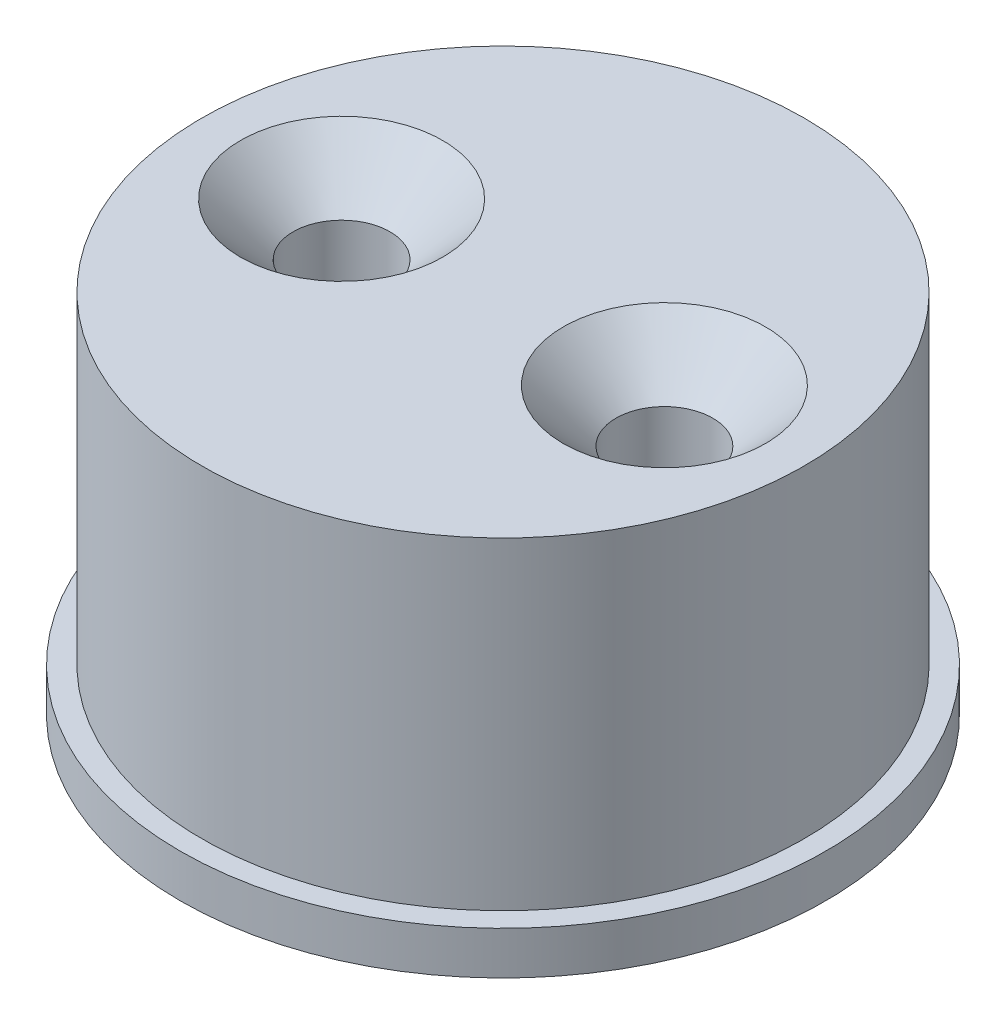
ISO-10303-21;
HEADER;
FILE_DESCRIPTION(('STEP AP214'),'2;1');
FILE_NAME('part.step','',(''),(''),'','','');
FILE_SCHEMA(('AUTOMOTIVE_DESIGN { 1 0 10303 214 1 1 1 1 }'));
ENDSEC;
DATA;
#1=APPLICATION_CONTEXT('core data for automotive mechanical design processes');
#2=APPLICATION_PROTOCOL_DEFINITION('international standard','automotive_design',2000,#1);
#3=PRODUCT_CONTEXT('',#1,'mechanical');
#4=PRODUCT('Part','Part','',(#3));
#5=PRODUCT_RELATED_PRODUCT_CATEGORY('part','',(#4));
#6=PRODUCT_DEFINITION_FORMATION('','',#4);
#7=PRODUCT_DEFINITION_CONTEXT('part definition',#1,'design');
#8=PRODUCT_DEFINITION('design','',#6,#7);
#9=PRODUCT_DEFINITION_SHAPE('','',#8);
#10=(LENGTH_UNIT() NAMED_UNIT(*) SI_UNIT(.MILLI.,.METRE.));
#11=(NAMED_UNIT(*) PLANE_ANGLE_UNIT() SI_UNIT($,.RADIAN.));
#12=(NAMED_UNIT(*) SI_UNIT($,.STERADIAN.) SOLID_ANGLE_UNIT());
#13=UNCERTAINTY_MEASURE_WITH_UNIT(LENGTH_MEASURE(1.E-05),#10,'distance_accuracy_value','');
#14=(GEOMETRIC_REPRESENTATION_CONTEXT(3) GLOBAL_UNCERTAINTY_ASSIGNED_CONTEXT((#13)) GLOBAL_UNIT_ASSIGNED_CONTEXT((#10,
#11,#12)) REPRESENTATION_CONTEXT('',''));
#15=CARTESIAN_POINT('',(0.,0.,0.));
#16=DIRECTION('',(0.,0.,1.));
#17=DIRECTION('',(1.,0.,0.));
#18=AXIS2_PLACEMENT_3D('',#15,#16,#17);
#19=CARTESIAN_POINT('',(-14.,17.,0.));
#20=DIRECTION('',(0.,-1.,0.));
#21=DIRECTION('',(0.,0.,-1.));
#22=AXIS2_PLACEMENT_3D('',#19,#20,#21);
#23=PLANE('',#22);
#24=CARTESIAN_POINT('',(7.5,17.,0.));
#25=DIRECTION('',(0.,1.,0.));
#26=DIRECTION('',(0.,0.,1.));
#27=AXIS2_PLACEMENT_3D('',#24,#25,#26);
#28=CIRCLE('',#27,4.7);
#29=CARTESIAN_POINT('',(7.5,17.,4.7));
#30=VERTEX_POINT('',#29);
#31=EDGE_CURVE('E68',#30,#30,#28,.T.);
#32=ORIENTED_EDGE('',*,*,#31,.F.);
#33=EDGE_LOOP('',(#32));
#34=FACE_BOUND('',#33,.T.);
#35=CARTESIAN_POINT('',(0.,17.,0.));
#36=DIRECTION('',(0.,-1.,0.));
#37=DIRECTION('',(0.,0.,-1.));
#38=AXIS2_PLACEMENT_3D('',#35,#36,#37);
#39=CIRCLE('',#38,14.);
#40=CARTESIAN_POINT('',(0.,17.,-14.));
#41=VERTEX_POINT('',#40);
#42=EDGE_CURVE('E57',#41,#41,#39,.T.);
#43=ORIENTED_EDGE('',*,*,#42,.F.);
#44=EDGE_LOOP('',(#43));
#45=FACE_BOUND('',#44,.T.);
#46=CARTESIAN_POINT('',(-7.5,17.,0.));
#47=DIRECTION('',(0.,1.,0.));
#48=DIRECTION('',(0.,0.,1.));
#49=AXIS2_PLACEMENT_3D('',#46,#47,#48);
#50=CIRCLE('',#49,4.7);
#51=CARTESIAN_POINT('',(-7.5,17.,4.7));
#52=VERTEX_POINT('',#51);
#53=EDGE_CURVE('E77',#52,#52,#50,.T.);
#54=ORIENTED_EDGE('',*,*,#53,.F.);
#55=EDGE_LOOP('',(#54));
#56=FACE_BOUND('',#55,.T.);
#57=ADVANCED_FACE('F42',(#34,#45,#56),#23,.F.);
#58=CARTESIAN_POINT('',(0.,0.,0.));
#59=DIRECTION('',(0.,1.,0.));
#60=DIRECTION('',(0.,0.,1.));
#61=AXIS2_PLACEMENT_3D('',#58,#59,#60);
#62=PLANE('',#61);
#63=CARTESIAN_POINT('',(-7.5,0.,0.));
#64=DIRECTION('',(0.,1.,0.));
#65=DIRECTION('',(0.,0.,1.));
#66=AXIS2_PLACEMENT_3D('',#63,#64,#65);
#67=CIRCLE('',#66,2.25);
#68=CARTESIAN_POINT('',(-7.5,0.,2.25));
#69=VERTEX_POINT('',#68);
#70=EDGE_CURVE('E71',#69,#69,#67,.T.);
#71=ORIENTED_EDGE('',*,*,#70,.T.);
#72=EDGE_LOOP('',(#71));
#73=FACE_BOUND('',#72,.T.);
#74=CARTESIAN_POINT('',(7.5,0.,0.));
#75=DIRECTION('',(0.,1.,0.));
#76=DIRECTION('',(0.,0.,1.));
#77=AXIS2_PLACEMENT_3D('',#74,#75,#76);
#78=CIRCLE('',#77,2.25);
#79=CARTESIAN_POINT('',(7.5,0.,2.25));
#80=VERTEX_POINT('',#79);
#81=EDGE_CURVE('E62',#80,#80,#78,.T.);
#82=ORIENTED_EDGE('',*,*,#81,.T.);
#83=EDGE_LOOP('',(#82));
#84=FACE_BOUND('',#83,.T.);
#85=CARTESIAN_POINT('',(0.,0.,0.));
#86=DIRECTION('',(0.,-1.,0.));
#87=DIRECTION('',(0.,0.,-1.));
#88=AXIS2_PLACEMENT_3D('',#85,#86,#87);
#89=CIRCLE('',#88,15.);
#90=CARTESIAN_POINT('',(0.,0.,-15.));
#91=VERTEX_POINT('',#90);
#92=EDGE_CURVE('E12',#91,#91,#89,.T.);
#93=ORIENTED_EDGE('',*,*,#92,.T.);
#94=EDGE_LOOP('',(#93));
#95=FACE_BOUND('',#94,.T.);
#96=ADVANCED_FACE('F44',(#73,#84,#95),#62,.F.);
#97=CARTESIAN_POINT('',(0.,0.,0.));
#98=DIRECTION('',(0.,-1.,0.));
#99=DIRECTION('',(0.,0.,-1.));
#100=AXIS2_PLACEMENT_3D('',#97,#98,#99);
#101=CYLINDRICAL_SURFACE('',#100,15.);
#102=ORIENTED_EDGE('',*,*,#92,.F.);
#103=EDGE_LOOP('',(#102));
#104=FACE_BOUND('',#103,.T.);
#105=CARTESIAN_POINT('',(0.,2.,0.));
#106=DIRECTION('',(0.,-1.,0.));
#107=DIRECTION('',(0.,0.,-1.));
#108=AXIS2_PLACEMENT_3D('',#105,#106,#107);
#109=CIRCLE('',#108,15.);
#110=CARTESIAN_POINT('',(0.,2.,-15.));
#111=VERTEX_POINT('',#110);
#112=EDGE_CURVE('E49',#111,#111,#109,.T.);
#113=ORIENTED_EDGE('',*,*,#112,.T.);
#114=EDGE_LOOP('',(#113));
#115=FACE_BOUND('',#114,.T.);
#116=ADVANCED_FACE('F89',(#104,#115),#101,.T.);
#117=CARTESIAN_POINT('',(-15.,2.,0.));
#118=DIRECTION('',(0.,-1.,0.));
#119=DIRECTION('',(0.,0.,-1.));
#120=AXIS2_PLACEMENT_3D('',#117,#118,#119);
#121=PLANE('',#120);
#122=ORIENTED_EDGE('',*,*,#112,.F.);
#123=EDGE_LOOP('',(#122));
#124=FACE_BOUND('',#123,.T.);
#125=CARTESIAN_POINT('',(0.,2.,0.));
#126=DIRECTION('',(0.,-1.,0.));
#127=DIRECTION('',(0.,0.,-1.));
#128=AXIS2_PLACEMENT_3D('',#125,#126,#127);
#129=CIRCLE('',#128,14.);
#130=CARTESIAN_POINT('',(0.,2.,-14.));
#131=VERTEX_POINT('',#130);
#132=EDGE_CURVE('E53',#131,#131,#129,.T.);
#133=ORIENTED_EDGE('',*,*,#132,.T.);
#134=EDGE_LOOP('',(#133));
#135=FACE_BOUND('',#134,.T.);
#136=ADVANCED_FACE('F100',(#124,#135),#121,.F.);
#137=CARTESIAN_POINT('',(0.,0.,0.));
#138=DIRECTION('',(0.,-1.,0.));
#139=DIRECTION('',(0.,0.,-1.));
#140=AXIS2_PLACEMENT_3D('',#137,#138,#139);
#141=CYLINDRICAL_SURFACE('',#140,14.);
#142=ORIENTED_EDGE('',*,*,#132,.F.);
#143=EDGE_LOOP('',(#142));
#144=FACE_BOUND('',#143,.T.);
#145=ORIENTED_EDGE('',*,*,#42,.T.);
#146=EDGE_LOOP('',(#145));
#147=FACE_BOUND('',#146,.T.);
#148=ADVANCED_FACE('F97',(#144,#147),#141,.T.);
#149=CARTESIAN_POINT('',(7.5,17.,0.));
#150=DIRECTION('',(0.,1.,0.));
#151=DIRECTION('',(0.,0.,1.));
#152=AXIS2_PLACEMENT_3D('',#149,#150,#151);
#153=CYLINDRICAL_SURFACE('',#152,2.25);
#154=ORIENTED_EDGE('',*,*,#81,.F.);
#155=EDGE_LOOP('',(#154));
#156=FACE_BOUND('',#155,.T.);
#157=CARTESIAN_POINT('',(7.5,14.55,0.));
#158=DIRECTION('',(0.,1.,0.));
#159=DIRECTION('',(0.,0.,1.));
#160=AXIS2_PLACEMENT_3D('',#157,#158,#159);
#161=CIRCLE('',#160,2.25);
#162=CARTESIAN_POINT('',(7.5,14.55,2.25));
#163=VERTEX_POINT('',#162);
#164=EDGE_CURVE('E65',#163,#163,#161,.T.);
#165=ORIENTED_EDGE('',*,*,#164,.T.);
#166=EDGE_LOOP('',(#165));
#167=FACE_BOUND('',#166,.T.);
#168=ADVANCED_FACE('F95',(#156,#167),#153,.F.);
#169=CARTESIAN_POINT('',(7.5,17.,0.));
#170=DIRECTION('',(0.,1.,0.));
#171=DIRECTION('',(0.,0.,1.));
#172=AXIS2_PLACEMENT_3D('',#169,#170,#171);
#173=CONICAL_SURFACE('',#172,4.7,0.785398163397448);
#174=ORIENTED_EDGE('',*,*,#164,.F.);
#175=EDGE_LOOP('',(#174));
#176=FACE_BOUND('',#175,.T.);
#177=ORIENTED_EDGE('',*,*,#31,.T.);
#178=EDGE_LOOP('',(#177));
#179=FACE_BOUND('',#178,.T.);
#180=ADVANCED_FACE('F124',(#176,#179),#173,.F.);
#181=CARTESIAN_POINT('',(-7.5,17.,0.));
#182=DIRECTION('',(0.,1.,0.));
#183=DIRECTION('',(0.,0.,1.));
#184=AXIS2_PLACEMENT_3D('',#181,#182,#183);
#185=CYLINDRICAL_SURFACE('',#184,2.25);
#186=ORIENTED_EDGE('',*,*,#70,.F.);
#187=EDGE_LOOP('',(#186));
#188=FACE_BOUND('',#187,.T.);
#189=CARTESIAN_POINT('',(-7.5,14.55,0.));
#190=DIRECTION('',(0.,1.,0.));
#191=DIRECTION('',(0.,0.,1.));
#192=AXIS2_PLACEMENT_3D('',#189,#190,#191);
#193=CIRCLE('',#192,2.25);
#194=CARTESIAN_POINT('',(-7.5,14.55,2.25));
#195=VERTEX_POINT('',#194);
#196=EDGE_CURVE('E74',#195,#195,#193,.T.);
#197=ORIENTED_EDGE('',*,*,#196,.T.);
#198=EDGE_LOOP('',(#197));
#199=FACE_BOUND('',#198,.T.);
#200=ADVANCED_FACE('F131',(#188,#199),#185,.F.);
#201=CARTESIAN_POINT('',(-7.5,17.,0.));
#202=DIRECTION('',(0.,1.,0.));
#203=DIRECTION('',(0.,0.,1.));
#204=AXIS2_PLACEMENT_3D('',#201,#202,#203);
#205=CONICAL_SURFACE('',#204,4.7,0.785398163397449);
#206=ORIENTED_EDGE('',*,*,#196,.F.);
#207=EDGE_LOOP('',(#206));
#208=FACE_BOUND('',#207,.T.);
#209=ORIENTED_EDGE('',*,*,#53,.T.);
#210=EDGE_LOOP('',(#209));
#211=FACE_BOUND('',#210,.T.);
#212=ADVANCED_FACE('F81',(#208,#211),#205,.F.);
#213=CLOSED_SHELL('',(#57,#96,#116,#136,#148,#168,#180,#200,#212));
#214=MANIFOLD_SOLID_BREP('B2',#213);
#215=ADVANCED_BREP_SHAPE_REPRESENTATION('',(#18,#214),#14);
#216=SHAPE_DEFINITION_REPRESENTATION(#9,#215);
ENDSEC;
END-ISO-10303-21;
